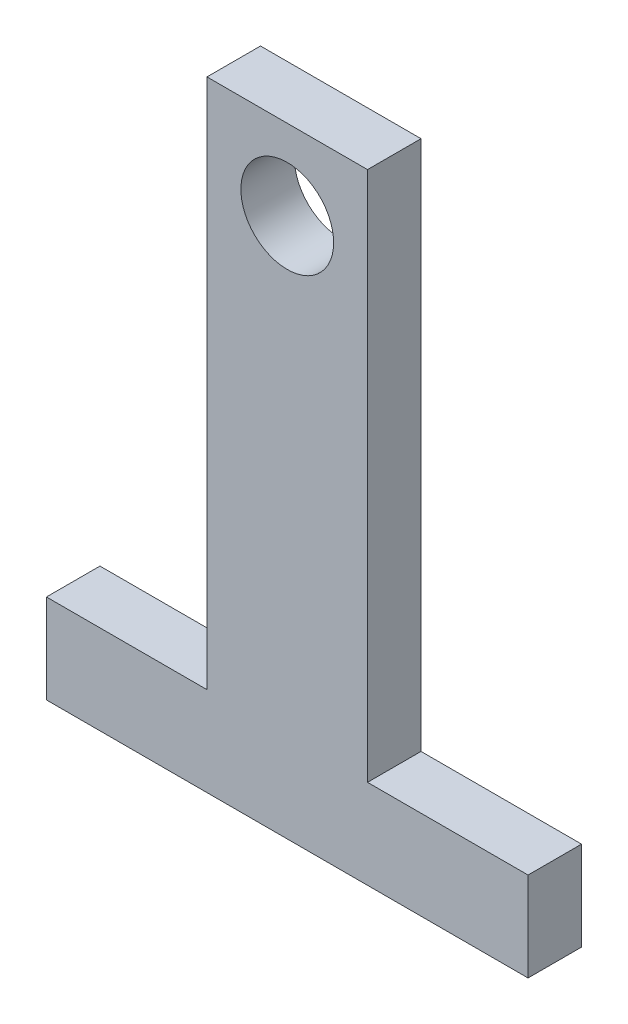
ISO-10303-21;
HEADER;
FILE_DESCRIPTION(('STEP AP214'),'2;1');
FILE_NAME('part.step','',(''),(''),'','','');
FILE_SCHEMA(('AUTOMOTIVE_DESIGN { 1 0 10303 214 1 1 1 1 }'));
ENDSEC;
DATA;
#1=APPLICATION_CONTEXT('core data for automotive mechanical design processes');
#2=APPLICATION_PROTOCOL_DEFINITION('international standard','automotive_design',2000,#1);
#3=PRODUCT_CONTEXT('',#1,'mechanical');
#4=PRODUCT('Part','Part','',(#3));
#5=PRODUCT_RELATED_PRODUCT_CATEGORY('part','',(#4));
#6=PRODUCT_DEFINITION_FORMATION('','',#4);
#7=PRODUCT_DEFINITION_CONTEXT('part definition',#1,'design');
#8=PRODUCT_DEFINITION('design','',#6,#7);
#9=PRODUCT_DEFINITION_SHAPE('','',#8);
#10=(LENGTH_UNIT() NAMED_UNIT(*) SI_UNIT(.MILLI.,.METRE.));
#11=(NAMED_UNIT(*) PLANE_ANGLE_UNIT() SI_UNIT($,.RADIAN.));
#12=(NAMED_UNIT(*) SI_UNIT($,.STERADIAN.) SOLID_ANGLE_UNIT());
#13=UNCERTAINTY_MEASURE_WITH_UNIT(LENGTH_MEASURE(1.E-05),#10,'distance_accuracy_value','');
#14=(GEOMETRIC_REPRESENTATION_CONTEXT(3) GLOBAL_UNCERTAINTY_ASSIGNED_CONTEXT((#13)) GLOBAL_UNIT_ASSIGNED_CONTEXT((#10,
#11,#12)) REPRESENTATION_CONTEXT('',''));
#15=CARTESIAN_POINT('',(0.,0.,0.));
#16=DIRECTION('',(0.,0.,1.));
#17=DIRECTION('',(1.,0.,0.));
#18=AXIS2_PLACEMENT_3D('',#15,#16,#17);
#19=CARTESIAN_POINT('',(0.,0.,3.));
#20=DIRECTION('',(0.,0.,-1.));
#21=DIRECTION('',(-1.,0.,0.));
#22=AXIS2_PLACEMENT_3D('',#19,#20,#21);
#23=PLANE('',#22);
#24=DIRECTION('',(-1.,0.,0.));
#25=VECTOR('',#24,1.);
#26=CARTESIAN_POINT('',(9.,0.,3.));
#27=LINE('',#26,#25);
#28=CARTESIAN_POINT('',(9.,0.,3.));
#29=VERTEX_POINT('',#28);
#30=CARTESIAN_POINT('',(0.,0.,3.));
#31=VERTEX_POINT('',#30);
#32=EDGE_CURVE('E145',#29,#31,#27,.T.);
#33=ORIENTED_EDGE('',*,*,#32,.T.);
#34=DIRECTION('',(0.,1.,0.));
#35=VECTOR('',#34,1.);
#36=CARTESIAN_POINT('',(0.,0.,3.));
#37=LINE('',#36,#35);
#38=CARTESIAN_POINT('',(0.,29.75,3.));
#39=VERTEX_POINT('',#38);
#40=EDGE_CURVE('E93',#31,#39,#37,.T.);
#41=ORIENTED_EDGE('',*,*,#40,.T.);
#42=DIRECTION('',(-1.,0.,0.));
#43=VECTOR('',#42,1.);
#44=CARTESIAN_POINT('',(0.,29.75,3.));
#45=LINE('',#44,#43);
#46=CARTESIAN_POINT('',(-9.,29.75,3.));
#47=VERTEX_POINT('',#46);
#48=EDGE_CURVE('E160',#39,#47,#45,.T.);
#49=ORIENTED_EDGE('',*,*,#48,.T.);
#50=DIRECTION('',(0.,-1.,0.));
#51=VECTOR('',#50,1.);
#52=CARTESIAN_POINT('',(-9.,0.,3.));
#53=LINE('',#52,#51);
#54=CARTESIAN_POINT('',(-9.,0.,3.));
#55=VERTEX_POINT('',#54);
#56=EDGE_CURVE('E173',#47,#55,#53,.T.);
#57=ORIENTED_EDGE('',*,*,#56,.T.);
#58=DIRECTION('',(-1.,0.,0.));
#59=VECTOR('',#58,1.);
#60=CARTESIAN_POINT('',(-9.,0.,3.));
#61=LINE('',#60,#59);
#62=CARTESIAN_POINT('',(-18.,0.,3.));
#63=VERTEX_POINT('',#62);
#64=EDGE_CURVE('E112',#55,#63,#61,.T.);
#65=ORIENTED_EDGE('',*,*,#64,.T.);
#66=DIRECTION('',(0.,-1.,0.));
#67=VECTOR('',#66,1.);
#68=CARTESIAN_POINT('',(-18.,0.,3.));
#69=LINE('',#68,#67);
#70=CARTESIAN_POINT('',(-18.,-5.,3.));
#71=VERTEX_POINT('',#70);
#72=EDGE_CURVE('E106',#63,#71,#69,.T.);
#73=ORIENTED_EDGE('',*,*,#72,.T.);
#74=DIRECTION('',(1.,0.,0.));
#75=VECTOR('',#74,1.);
#76=CARTESIAN_POINT('',(-18.,-5.,3.));
#77=LINE('',#76,#75);
#78=CARTESIAN_POINT('',(9.,-5.,3.));
#79=VERTEX_POINT('',#78);
#80=EDGE_CURVE('E110',#71,#79,#77,.T.);
#81=ORIENTED_EDGE('',*,*,#80,.T.);
#82=DIRECTION('',(0.,1.,0.));
#83=VECTOR('',#82,1.);
#84=CARTESIAN_POINT('',(9.,-5.,3.));
#85=LINE('',#84,#83);
#86=EDGE_CURVE('E50',#79,#29,#85,.T.);
#87=ORIENTED_EDGE('',*,*,#86,.T.);
#88=EDGE_LOOP('',(#33,#41,#49,#57,#65,#73,#81,#87));
#89=FACE_BOUND('',#88,.T.);
#90=CARTESIAN_POINT('',(-4.5,25.25,3.));
#91=DIRECTION('',(0.,0.,1.));
#92=DIRECTION('',(1.,0.,0.));
#93=AXIS2_PLACEMENT_3D('',#90,#91,#92);
#94=CIRCLE('',#93,2.6);
#95=CARTESIAN_POINT('',(-1.9,25.25,3.));
#96=VERTEX_POINT('',#95);
#97=EDGE_CURVE('E134',#96,#96,#94,.T.);
#98=ORIENTED_EDGE('',*,*,#97,.F.);
#99=EDGE_LOOP('',(#98));
#100=FACE_BOUND('',#99,.T.);
#101=ADVANCED_FACE('F33',(#89,#100),#23,.F.);
#102=CARTESIAN_POINT('',(0.,0.,0.));
#103=DIRECTION('',(0.,0.,-1.));
#104=DIRECTION('',(-1.,0.,0.));
#105=AXIS2_PLACEMENT_3D('',#102,#103,#104);
#106=PLANE('',#105);
#107=DIRECTION('',(-1.,0.,0.));
#108=VECTOR('',#107,1.);
#109=CARTESIAN_POINT('',(9.,0.,0.));
#110=LINE('',#109,#108);
#111=CARTESIAN_POINT('',(9.,0.,0.));
#112=VERTEX_POINT('',#111);
#113=CARTESIAN_POINT('',(0.,0.,0.));
#114=VERTEX_POINT('',#113);
#115=EDGE_CURVE('E130',#112,#114,#110,.T.);
#116=ORIENTED_EDGE('',*,*,#115,.F.);
#117=DIRECTION('',(0.,1.,0.));
#118=VECTOR('',#117,1.);
#119=CARTESIAN_POINT('',(9.,-5.,0.));
#120=LINE('',#119,#118);
#121=CARTESIAN_POINT('',(9.,-5.,0.));
#122=VERTEX_POINT('',#121);
#123=EDGE_CURVE('E85',#122,#112,#120,.T.);
#124=ORIENTED_EDGE('',*,*,#123,.F.);
#125=DIRECTION('',(1.,0.,0.));
#126=VECTOR('',#125,1.);
#127=CARTESIAN_POINT('',(-18.,-5.,0.));
#128=LINE('',#127,#126);
#129=CARTESIAN_POINT('',(-18.,-5.,0.));
#130=VERTEX_POINT('',#129);
#131=EDGE_CURVE('E79',#130,#122,#128,.T.);
#132=ORIENTED_EDGE('',*,*,#131,.F.);
#133=DIRECTION('',(0.,-1.,0.));
#134=VECTOR('',#133,1.);
#135=CARTESIAN_POINT('',(-18.,0.,0.));
#136=LINE('',#135,#134);
#137=CARTESIAN_POINT('',(-18.,0.,0.));
#138=VERTEX_POINT('',#137);
#139=EDGE_CURVE('E120',#138,#130,#136,.T.);
#140=ORIENTED_EDGE('',*,*,#139,.F.);
#141=DIRECTION('',(-1.,0.,0.));
#142=VECTOR('',#141,1.);
#143=CARTESIAN_POINT('',(-9.,0.,0.));
#144=LINE('',#143,#142);
#145=CARTESIAN_POINT('',(-9.,0.,0.));
#146=VERTEX_POINT('',#145);
#147=EDGE_CURVE('E140',#146,#138,#144,.T.);
#148=ORIENTED_EDGE('',*,*,#147,.F.);
#149=DIRECTION('',(0.,-1.,0.));
#150=VECTOR('',#149,1.);
#151=CARTESIAN_POINT('',(-9.,0.,0.));
#152=LINE('',#151,#150);
#153=CARTESIAN_POINT('',(-9.,29.75,0.));
#154=VERTEX_POINT('',#153);
#155=EDGE_CURVE('E138',#154,#146,#152,.T.);
#156=ORIENTED_EDGE('',*,*,#155,.F.);
#157=DIRECTION('',(-1.,0.,0.));
#158=VECTOR('',#157,1.);
#159=CARTESIAN_POINT('',(0.,29.75,0.));
#160=LINE('',#159,#158);
#161=CARTESIAN_POINT('',(0.,29.75,0.));
#162=VERTEX_POINT('',#161);
#163=EDGE_CURVE('E136',#162,#154,#160,.T.);
#164=ORIENTED_EDGE('',*,*,#163,.F.);
#165=DIRECTION('',(0.,1.,0.));
#166=VECTOR('',#165,1.);
#167=CARTESIAN_POINT('',(0.,0.,0.));
#168=LINE('',#167,#166);
#169=EDGE_CURVE('E133',#114,#162,#168,.T.);
#170=ORIENTED_EDGE('',*,*,#169,.F.);
#171=EDGE_LOOP('',(#116,#124,#132,#140,#148,#156,#164,#170));
#172=FACE_BOUND('',#171,.T.);
#173=CARTESIAN_POINT('',(-4.5,25.25,0.));
#174=DIRECTION('',(0.,0.,1.));
#175=DIRECTION('',(1.,0.,0.));
#176=AXIS2_PLACEMENT_3D('',#173,#174,#175);
#177=CIRCLE('',#176,2.6);
#178=CARTESIAN_POINT('',(-1.9,25.25,0.));
#179=VERTEX_POINT('',#178);
#180=EDGE_CURVE('E179',#179,#179,#177,.T.);
#181=ORIENTED_EDGE('',*,*,#180,.T.);
#182=EDGE_LOOP('',(#181));
#183=FACE_BOUND('',#182,.T.);
#184=ADVANCED_FACE('F164',(#172,#183),#106,.T.);
#185=CARTESIAN_POINT('',(9.,0.,3.));
#186=DIRECTION('',(0.,-1.,0.));
#187=DIRECTION('',(1.,0.,0.));
#188=AXIS2_PLACEMENT_3D('',#185,#186,#187);
#189=PLANE('',#188);
#190=ORIENTED_EDGE('',*,*,#115,.T.);
#191=DIRECTION('',(0.,0.,-1.));
#192=VECTOR('',#191,1.);
#193=CARTESIAN_POINT('',(0.,0.,3.));
#194=LINE('',#193,#192);
#195=EDGE_CURVE('E11',#31,#114,#194,.T.);
#196=ORIENTED_EDGE('',*,*,#195,.F.);
#197=ORIENTED_EDGE('',*,*,#32,.F.);
#198=DIRECTION('',(0.,0.,-1.));
#199=VECTOR('',#198,1.);
#200=CARTESIAN_POINT('',(9.,0.,3.));
#201=LINE('',#200,#199);
#202=EDGE_CURVE('E126',#29,#112,#201,.T.);
#203=ORIENTED_EDGE('',*,*,#202,.T.);
#204=EDGE_LOOP('',(#190,#196,#197,#203));
#205=FACE_BOUND('',#204,.T.);
#206=ADVANCED_FACE('F35',(#205),#189,.F.);
#207=CARTESIAN_POINT('',(0.,0.,3.));
#208=DIRECTION('',(-1.,0.,0.));
#209=DIRECTION('',(0.,0.,1.));
#210=AXIS2_PLACEMENT_3D('',#207,#208,#209);
#211=PLANE('',#210);
#212=ORIENTED_EDGE('',*,*,#169,.T.);
#213=DIRECTION('',(0.,0.,-1.));
#214=VECTOR('',#213,1.);
#215=CARTESIAN_POINT('',(0.,29.75,3.));
#216=LINE('',#215,#214);
#217=EDGE_CURVE('E42',#39,#162,#216,.T.);
#218=ORIENTED_EDGE('',*,*,#217,.F.);
#219=ORIENTED_EDGE('',*,*,#40,.F.);
#220=ORIENTED_EDGE('',*,*,#195,.T.);
#221=EDGE_LOOP('',(#212,#218,#219,#220));
#222=FACE_BOUND('',#221,.T.);
#223=ADVANCED_FACE('F207',(#222),#211,.F.);
#224=CARTESIAN_POINT('',(0.,29.75,3.));
#225=DIRECTION('',(0.,-1.,0.));
#226=DIRECTION('',(0.,0.,-1.));
#227=AXIS2_PLACEMENT_3D('',#224,#225,#226);
#228=PLANE('',#227);
#229=ORIENTED_EDGE('',*,*,#163,.T.);
#230=DIRECTION('',(0.,0.,-1.));
#231=VECTOR('',#230,1.);
#232=CARTESIAN_POINT('',(-9.,29.75,3.));
#233=LINE('',#232,#231);
#234=EDGE_CURVE('E152',#47,#154,#233,.T.);
#235=ORIENTED_EDGE('',*,*,#234,.F.);
#236=ORIENTED_EDGE('',*,*,#48,.F.);
#237=ORIENTED_EDGE('',*,*,#217,.T.);
#238=EDGE_LOOP('',(#229,#235,#236,#237));
#239=FACE_BOUND('',#238,.T.);
#240=ADVANCED_FACE('F158',(#239),#228,.F.);
#241=CARTESIAN_POINT('',(-9.,0.,3.));
#242=DIRECTION('',(1.,0.,0.));
#243=DIRECTION('',(0.,0.,-1.));
#244=AXIS2_PLACEMENT_3D('',#241,#242,#243);
#245=PLANE('',#244);
#246=ORIENTED_EDGE('',*,*,#155,.T.);
#247=DIRECTION('',(0.,0.,-1.));
#248=VECTOR('',#247,1.);
#249=CARTESIAN_POINT('',(-9.,0.,3.));
#250=LINE('',#249,#248);
#251=EDGE_CURVE('E149',#55,#146,#250,.T.);
#252=ORIENTED_EDGE('',*,*,#251,.F.);
#253=ORIENTED_EDGE('',*,*,#56,.F.);
#254=ORIENTED_EDGE('',*,*,#234,.T.);
#255=EDGE_LOOP('',(#246,#252,#253,#254));
#256=FACE_BOUND('',#255,.T.);
#257=ADVANCED_FACE('F169',(#256),#245,.F.);
#258=CARTESIAN_POINT('',(-9.,0.,3.));
#259=DIRECTION('',(0.,-1.,0.));
#260=DIRECTION('',(1.,0.,0.));
#261=AXIS2_PLACEMENT_3D('',#258,#259,#260);
#262=PLANE('',#261);
#263=ORIENTED_EDGE('',*,*,#147,.T.);
#264=DIRECTION('',(0.,0.,-1.));
#265=VECTOR('',#264,1.);
#266=CARTESIAN_POINT('',(-18.,0.,3.));
#267=LINE('',#266,#265);
#268=EDGE_CURVE('E121',#63,#138,#267,.T.);
#269=ORIENTED_EDGE('',*,*,#268,.F.);
#270=ORIENTED_EDGE('',*,*,#64,.F.);
#271=ORIENTED_EDGE('',*,*,#251,.T.);
#272=EDGE_LOOP('',(#263,#269,#270,#271));
#273=FACE_BOUND('',#272,.T.);
#274=ADVANCED_FACE('F172',(#273),#262,.F.);
#275=CARTESIAN_POINT('',(-18.,0.,3.));
#276=DIRECTION('',(1.,0.,0.));
#277=DIRECTION('',(0.,0.,-1.));
#278=AXIS2_PLACEMENT_3D('',#275,#276,#277);
#279=PLANE('',#278);
#280=ORIENTED_EDGE('',*,*,#139,.T.);
#281=DIRECTION('',(0.,0.,-1.));
#282=VECTOR('',#281,1.);
#283=CARTESIAN_POINT('',(-18.,-5.,3.));
#284=LINE('',#283,#282);
#285=EDGE_CURVE('E117',#71,#130,#284,.T.);
#286=ORIENTED_EDGE('',*,*,#285,.F.);
#287=ORIENTED_EDGE('',*,*,#72,.F.);
#288=ORIENTED_EDGE('',*,*,#268,.T.);
#289=EDGE_LOOP('',(#280,#286,#287,#288));
#290=FACE_BOUND('',#289,.T.);
#291=ADVANCED_FACE('F118',(#290),#279,.F.);
#292=CARTESIAN_POINT('',(-18.,-5.,3.));
#293=DIRECTION('',(0.,1.,0.));
#294=DIRECTION('',(0.,0.,1.));
#295=AXIS2_PLACEMENT_3D('',#292,#293,#294);
#296=PLANE('',#295);
#297=ORIENTED_EDGE('',*,*,#131,.T.);
#298=DIRECTION('',(0.,0.,-1.));
#299=VECTOR('',#298,1.);
#300=CARTESIAN_POINT('',(9.,-5.,3.));
#301=LINE('',#300,#299);
#302=EDGE_CURVE('E122',#79,#122,#301,.T.);
#303=ORIENTED_EDGE('',*,*,#302,.F.);
#304=ORIENTED_EDGE('',*,*,#80,.F.);
#305=ORIENTED_EDGE('',*,*,#285,.T.);
#306=EDGE_LOOP('',(#297,#303,#304,#305));
#307=FACE_BOUND('',#306,.T.);
#308=ADVANCED_FACE('F124',(#307),#296,.F.);
#309=CARTESIAN_POINT('',(9.,-5.,3.));
#310=DIRECTION('',(-1.,0.,0.));
#311=DIRECTION('',(0.,-1.,0.));
#312=AXIS2_PLACEMENT_3D('',#309,#310,#311);
#313=PLANE('',#312);
#314=ORIENTED_EDGE('',*,*,#123,.T.);
#315=ORIENTED_EDGE('',*,*,#202,.F.);
#316=ORIENTED_EDGE('',*,*,#86,.F.);
#317=ORIENTED_EDGE('',*,*,#302,.T.);
#318=EDGE_LOOP('',(#314,#315,#316,#317));
#319=FACE_BOUND('',#318,.T.);
#320=ADVANCED_FACE('F195',(#319),#313,.F.);
#321=CARTESIAN_POINT('',(-4.5,25.25,3.));
#322=DIRECTION('',(0.,0.,-1.));
#323=DIRECTION('',(-1.,0.,0.));
#324=AXIS2_PLACEMENT_3D('',#321,#322,#323);
#325=CYLINDRICAL_SURFACE('',#324,2.6);
#326=ORIENTED_EDGE('',*,*,#97,.T.);
#327=EDGE_LOOP('',(#326));
#328=FACE_BOUND('',#327,.T.);
#329=ORIENTED_EDGE('',*,*,#180,.F.);
#330=EDGE_LOOP('',(#329));
#331=FACE_BOUND('',#330,.T.);
#332=ADVANCED_FACE('F185',(#328,#331),#325,.F.);
#333=CLOSED_SHELL('',(#101,#184,#206,#223,#240,#257,#274,#291,#308,#320,#332));
#334=MANIFOLD_SOLID_BREP('B2',#333);
#335=ADVANCED_BREP_SHAPE_REPRESENTATION('',(#18,#334),#14);
#336=SHAPE_DEFINITION_REPRESENTATION(#9,#335);
ENDSEC;
END-ISO-10303-21;
